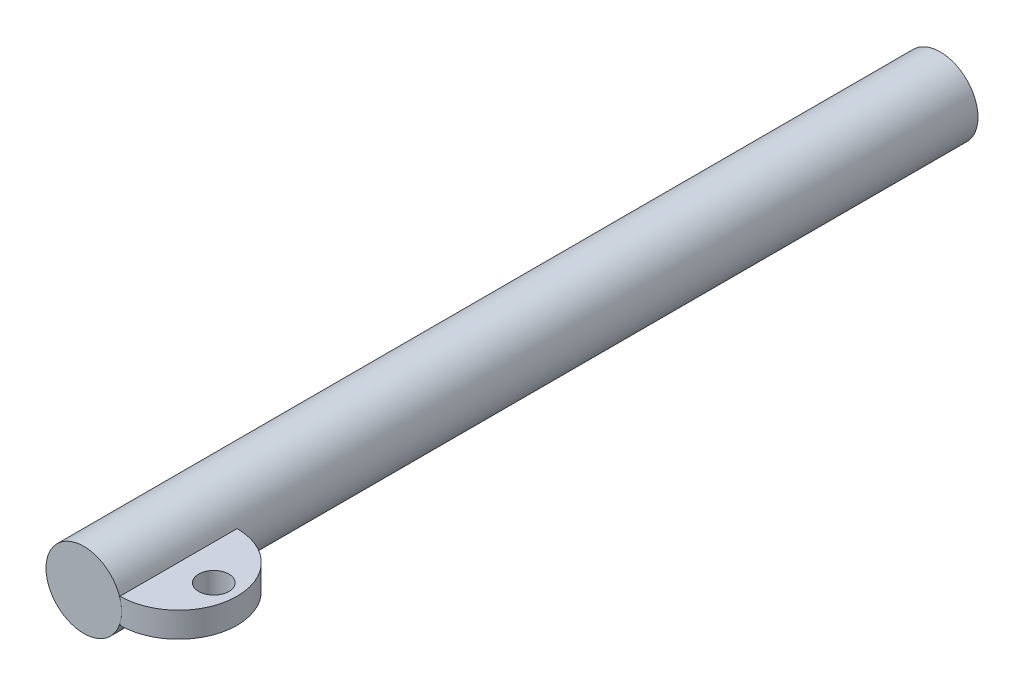
ISO-10303-21;
HEADER;
FILE_DESCRIPTION(('STEP AP214'),'2;1');
FILE_NAME('part.step','',(''),(''),'','','');
FILE_SCHEMA(('AUTOMOTIVE_DESIGN { 1 0 10303 214 1 1 1 1 }'));
ENDSEC;
DATA;
#1=APPLICATION_CONTEXT('core data for automotive mechanical design processes');
#2=APPLICATION_PROTOCOL_DEFINITION('international standard','automotive_design',2000,#1);
#3=PRODUCT_CONTEXT('',#1,'mechanical');
#4=PRODUCT('Part','Part','',(#3));
#5=PRODUCT_RELATED_PRODUCT_CATEGORY('part','',(#4));
#6=PRODUCT_DEFINITION_FORMATION('','',#4);
#7=PRODUCT_DEFINITION_CONTEXT('part definition',#1,'design');
#8=PRODUCT_DEFINITION('design','',#6,#7);
#9=PRODUCT_DEFINITION_SHAPE('','',#8);
#10=(LENGTH_UNIT() NAMED_UNIT(*) SI_UNIT(.MILLI.,.METRE.));
#11=(NAMED_UNIT(*) PLANE_ANGLE_UNIT() SI_UNIT($,.RADIAN.));
#12=(NAMED_UNIT(*) SI_UNIT($,.STERADIAN.) SOLID_ANGLE_UNIT());
#13=UNCERTAINTY_MEASURE_WITH_UNIT(LENGTH_MEASURE(1.E-05),#10,'distance_accuracy_value','');
#14=(GEOMETRIC_REPRESENTATION_CONTEXT(3) GLOBAL_UNCERTAINTY_ASSIGNED_CONTEXT((#13)) GLOBAL_UNIT_ASSIGNED_CONTEXT((#10,
#11,#12)) REPRESENTATION_CONTEXT('',''));
#15=CARTESIAN_POINT('',(0.,0.,0.));
#16=DIRECTION('',(0.,0.,1.));
#17=DIRECTION('',(1.,0.,0.));
#18=AXIS2_PLACEMENT_3D('',#15,#16,#17);
#19=CARTESIAN_POINT('',(0.,0.,-431.8));
#20=DIRECTION('',(0.,0.,1.));
#21=DIRECTION('',(1.,0.,0.));
#22=AXIS2_PLACEMENT_3D('',#19,#20,#21);
#23=CYLINDRICAL_SURFACE('',#22,19.05);
#24=CARTESIAN_POINT('',(0.,0.,-431.8));
#25=DIRECTION('',(0.,0.,1.));
#26=DIRECTION('',(1.,0.,0.));
#27=AXIS2_PLACEMENT_3D('',#24,#25,#26);
#28=CIRCLE('',#27,19.05);
#29=CARTESIAN_POINT('',(19.05,0.,-431.8));
#30=VERTEX_POINT('',#29);
#31=EDGE_CURVE('E11',#30,#30,#28,.T.);
#32=ORIENTED_EDGE('',*,*,#31,.T.);
#33=EDGE_LOOP('',(#32));
#34=FACE_BOUND('',#33,.T.);
#35=CARTESIAN_POINT('',(0.,0.,0.));
#36=DIRECTION('',(0.,0.,1.));
#37=DIRECTION('',(1.,0.,0.));
#38=AXIS2_PLACEMENT_3D('',#35,#36,#37);
#39=CIRCLE('',#38,19.05);
#40=CARTESIAN_POINT('',(18.2311661506708,5.52513174382622,0.));
#41=VERTEX_POINT('',#40);
#42=CARTESIAN_POINT('',(18.2311661506708,-5.52513174382622,0.));
#43=VERTEX_POINT('',#42);
#44=EDGE_CURVE('E47',#41,#43,#39,.T.);
#45=ORIENTED_EDGE('',*,*,#44,.F.);
#46=DIRECTION('',(0.,0.,1.));
#47=VECTOR('',#46,1.);
#48=CARTESIAN_POINT('',(18.2311661506708,5.52513174382622,-431.8));
#49=LINE('',#48,#47);
#50=CARTESIAN_POINT('',(18.2311661506708,5.52513174382622,-59.0746447566882));
#51=VERTEX_POINT('',#50);
#52=EDGE_CURVE('E62',#41,#51,#49,.F.);
#53=ORIENTED_EDGE('',*,*,#52,.T.);
#54=CARTESIAN_POINT('',(19.05,0.,-59.0632927164958));
#55=CARTESIAN_POINT('',(19.0499974495223,-0.533410332689084,-59.0632954058932));
#56=CARTESIAN_POINT('',(19.0275730764012,-1.06701268640046,-59.063940947908));
#57=CARTESIAN_POINT('',(18.9380000171682,-2.13068335039977,-59.0662193871342));
#58=CARTESIAN_POINT('',(18.870823131014,-2.66074921938288,-59.0678529068434));
#59=CARTESIAN_POINT('',(18.6919752162013,-3.71468658943576,-59.0711857572808));
#60=CARTESIAN_POINT('',(18.5801955089816,-4.23853971842063,-59.0728852395341));
#61=CARTESIAN_POINT('',(18.3129560661028,-5.27489114842086,-59.0748333147001));
#62=CARTESIAN_POINT('',(18.1575032761627,-5.78739124103923,-59.0750821381873));
#63=CARTESIAN_POINT('',(17.8040975935901,-6.79725269338584,-59.0720851750262));
#64=CARTESIAN_POINT('',(17.6061643924364,-7.29462094581438,-59.0688410047398));
#65=CARTESIAN_POINT('',(17.1691749588654,-8.27091062242221,-59.0563558909595));
#66=CARTESIAN_POINT('',(16.9301168989702,-8.74983122567972,-59.0471146809227));
#67=CARTESIAN_POINT('',(16.4128282149691,-9.68540707613082,-59.0197590281273));
#68=CARTESIAN_POINT('',(16.1346210071084,-10.142075414823,-59.0016498736035));
#69=CARTESIAN_POINT('',(15.541136456744,-11.0299908304216,-58.9534021036874));
#70=CARTESIAN_POINT('',(15.2258602420524,-11.4612386801389,-58.9232638542097));
#71=CARTESIAN_POINT('',(14.5657555414277,-12.2889126677761,-58.8481884743355));
#72=CARTESIAN_POINT('',(14.2214215462537,-12.6857528753035,-58.8034721411439));
#73=CARTESIAN_POINT('',(13.5025006903744,-13.4484036218518,-58.6959434125296));
#74=CARTESIAN_POINT('',(13.127914004805,-13.8142143404805,-58.6331311218608));
#75=CARTESIAN_POINT('',(12.3524357561648,-14.5117768362683,-58.4864075765619));
#76=CARTESIAN_POINT('',(11.9515580098741,-14.8435462717845,-58.4025073396767));
#77=CARTESIAN_POINT('',(11.1277007341616,-15.4707707390735,-58.2108808454866));
#78=CARTESIAN_POINT('',(10.7047227817724,-15.7662283569653,-58.1031562864757));
#79=CARTESIAN_POINT('',(9.87003341365052,-16.3007412185842,-57.8696382452585));
#80=CARTESIAN_POINT('',(9.45941394462734,-16.542229279102,-57.7455015172433));
#81=CARTESIAN_POINT('',(8.6275500456063,-16.9909145284858,-57.4732390338553));
#82=CARTESIAN_POINT('',(8.2063061727696,-17.1981135112363,-57.3251145342414));
#83=CARTESIAN_POINT('',(7.35777227272936,-17.5778762250717,-57.004182867408));
#84=CARTESIAN_POINT('',(6.93048333172923,-17.7504460959309,-56.8313800849875));
#85=CARTESIAN_POINT('',(6.07425235172059,-18.0613794622432,-56.4609261303484));
#86=CARTESIAN_POINT('',(5.64531029775275,-18.199742647412,-56.2632747327557));
#87=CARTESIAN_POINT('',(4.80214886916259,-18.439863696832,-55.8494715066232));
#88=CARTESIAN_POINT('',(4.38785663721806,-18.5425474571487,-55.6340023414693));
#89=CARTESIAN_POINT('',(3.56527364267798,-18.7181250911846,-55.1807530956983));
#90=CARTESIAN_POINT('',(3.15698260089155,-18.7910203549974,-54.9429740568185));
#91=CARTESIAN_POINT('',(2.34937215791158,-18.9089804047507,-54.4460931602824));
#92=CARTESIAN_POINT('',(1.95005472263788,-18.9540391485085,-54.1869866871242));
#93=CARTESIAN_POINT('',(1.16300961286429,-19.0185671682213,-53.6487078873416));
#94=CARTESIAN_POINT('',(0.775284343316429,-19.0380311697099,-53.3695314372709));
#95=CARTESIAN_POINT('',(-0.134556596742535,-19.0568681592176,-52.6802197263516));
#96=CARTESIAN_POINT('',(-0.650324843735161,-19.045490059431,-52.2613631975699));
#97=CARTESIAN_POINT('',(-1.65121616525916,-18.9849307792628,-51.3910313832574));
#98=CARTESIAN_POINT('',(-2.13632927143914,-18.9357373699677,-50.9395455887021));
#99=CARTESIAN_POINT('',(-3.07399765655121,-18.8063146962617,-50.0063676909387));
#100=CARTESIAN_POINT('',(-3.52648480965315,-18.7260226011192,-49.524616101235));
#101=CARTESIAN_POINT('',(-4.39600780414732,-18.5411762577534,-48.5346534501916));
#102=CARTESIAN_POINT('',(-4.8130430250869,-18.4366215850243,-48.0264419260212));
#103=CARTESIAN_POINT('',(-5.72307186041503,-18.1777738319722,-46.8391764633674));
#104=CARTESIAN_POINT('',(-6.20432554341778,-18.0177688882982,-46.1523569886721));
#105=CARTESIAN_POINT('',(-7.10535866264219,-17.6818432432793,-44.7430361253001));
#106=CARTESIAN_POINT('',(-7.5251232603516,-17.5059187167449,-44.0205261798848));
#107=CARTESIAN_POINT('',(-8.10762091903377,-17.2399125735263,-42.9125204730872));
#108=CARTESIAN_POINT('',(-8.29397886114145,-17.1508628052949,-42.5390260147538));
#109=CARTESIAN_POINT('',(-8.65072584911805,-16.9737175187501,-41.7844216991225));
#110=CARTESIAN_POINT('',(-8.82111986190445,-16.8856217112228,-41.4033142555545));
#111=CARTESIAN_POINT('',(-9.30810183725057,-16.6252007952014,-40.2489753021264));
#112=CARTESIAN_POINT('',(-9.60060813524538,-16.4566862426988,-39.4645020133286));
#113=CARTESIAN_POINT('',(-10.078136561872,-16.1678331754576,-37.9952068825379));
#114=CARTESIAN_POINT('',(-10.2728341536033,-16.0440880173047,-37.3141757470449));
#115=CARTESIAN_POINT('',(-10.6134693950877,-15.8208193897522,-35.9360684439627));
#116=CARTESIAN_POINT('',(-10.7594124281181,-15.7212932465188,-35.238994056894));
#117=CARTESIAN_POINT('',(-11.0006403265369,-15.5534586096181,-33.8340272999519));
#118=CARTESIAN_POINT('',(-11.0960415326009,-15.4850784732955,-33.1261636671064));
#119=CARTESIAN_POINT('',(-11.2353457906023,-15.3843099270789,-31.7027999762613));
#120=CARTESIAN_POINT('',(-11.2792509392299,-15.3519200518245,-30.9873002303673));
#121=CARTESIAN_POINT('',(-11.3149104574173,-15.3256592376619,-29.5516572830223));
#122=CARTESIAN_POINT('',(-11.3064737233067,-15.3319294487663,-28.8315066670718));
#123=CARTESIAN_POINT('',(-11.2371461511756,-15.3828097321299,-27.3951105338666));
#124=CARTESIAN_POINT('',(-11.1762534007598,-15.4274212022007,-26.6788651599439));
#125=CARTESIAN_POINT('',(-11.0028690196664,-15.5515479281147,-25.2548103004364));
#126=CARTESIAN_POINT('',(-10.8903082042545,-15.6311099774305,-24.5470134355544));
#127=CARTESIAN_POINT('',(-10.615062337509,-15.8193119260165,-23.1452291037281));
#128=CARTESIAN_POINT('',(-10.452374620779,-15.9279533714842,-22.451242373199));
#129=CARTESIAN_POINT('',(-10.0836465736133,-16.1638193390707,-21.0991721541365));
#130=CARTESIAN_POINT('',(-9.87891481023732,-16.2904537943834,-20.4406258764063));
#131=CARTESIAN_POINT('',(-9.42498400488311,-16.5572172119949,-19.1419404844225));
#132=CARTESIAN_POINT('',(-9.17578694618822,-16.6973455722976,-18.5018005506696));
#133=CARTESIAN_POINT('',(-8.63364164766201,-16.984018017731,-17.2406856381606));
#134=CARTESIAN_POINT('',(-8.34063091916859,-17.1305710514518,-16.6197395861384));
#135=CARTESIAN_POINT('',(-7.71197767345019,-17.4226307883418,-15.3995057824057));
#136=CARTESIAN_POINT('',(-7.37633045594906,-17.5681373742785,-14.8002204279563));
#137=CARTESIAN_POINT('',(-6.58494548921102,-17.8818248471692,-13.4962504224883));
#138=CARTESIAN_POINT('',(-6.11900582923667,-18.0479928569209,-12.7972252974813));
#139=CARTESIAN_POINT('',(-5.12609036375175,-18.3547242361447,-11.4375727357206));
#140=CARTESIAN_POINT('',(-4.59909676141984,-18.4952801089742,-10.7769565796312));
#141=CARTESIAN_POINT('',(-3.48757225709849,-18.7366388314036,-9.50077922376731));
#142=CARTESIAN_POINT('',(-2.90319958478497,-18.8375473676265,-8.88510185328883));
#143=CARTESIAN_POINT('',(-1.98621448064334,-18.9486734699456,-7.99917633549305));
#144=CARTESIAN_POINT('',(-1.67389615226275,-18.9790068921689,-7.71019878539144));
#145=CARTESIAN_POINT('',(-1.03634152792483,-19.0244746814373,-7.14540692538731));
#146=CARTESIAN_POINT('',(-0.711102643313344,-19.0396059865859,-6.86959527791303));
#147=CARTESIAN_POINT('',(0.0306760328246975,-19.0544002431947,-6.26770596591488));
#148=CARTESIAN_POINT('',(0.450414287587034,-19.0494862522862,-5.94542584701397));
#149=CARTESIAN_POINT('',(1.30558757245027,-19.0100257982271,-5.32457185031872));
#150=CARTESIAN_POINT('',(1.74101765993906,-18.9754885889813,-5.02599060112869));
#151=CARTESIAN_POINT('',(2.62430476366712,-18.873605987584,-4.45434389512109));
#152=CARTESIAN_POINT('',(3.0721541351599,-18.8062803735253,-4.18126317447804));
#153=CARTESIAN_POINT('',(3.9766511103939,-18.635999800388,-3.66196466576827));
#154=CARTESIAN_POINT('',(4.43329896928359,-18.5330438065866,-3.41574765810948));
#155=CARTESIAN_POINT('',(5.35379359973416,-18.2884557295841,-2.94983479134847));
#156=CARTESIAN_POINT('',(5.81766794160454,-18.146574465427,-2.73032342399081));
#157=CARTESIAN_POINT('',(6.74437860977575,-17.822926315774,-2.32034522760761));
#158=CARTESIAN_POINT('',(7.20721493347212,-17.6411593303151,-2.12987847137677));
#159=CARTESIAN_POINT('',(8.12615135630616,-17.2371703061297,-1.77792435643122));
#160=CARTESIAN_POINT('',(8.58225217847091,-17.0149526442425,-1.61643386618031));
#161=CARTESIAN_POINT('',(9.48203796398859,-16.5304109946022,-1.32154107592938));
#162=CARTESIAN_POINT('',(9.92572380753314,-16.268089858654,-1.18813678028951));
#163=CARTESIAN_POINT('',(10.7531878629985,-15.7318334602047,-0.959368970685725));
#164=CARTESIAN_POINT('',(11.1386143968101,-15.4614643027558,-0.861576313698964));
#165=CARTESIAN_POINT('',(11.8911214153813,-14.890492280394,-0.685866141013246));
#166=CARTESIAN_POINT('',(12.25820323811,-14.5898916252428,-0.607947174123208));
#167=CARTESIAN_POINT('',(12.9707281556607,-13.9602575991614,-0.469935973060626));
#168=CARTESIAN_POINT('',(13.3161691193484,-13.6312214355459,-0.409845492420103));
#169=CARTESIAN_POINT('',(13.9824780087536,-12.9468496941845,-0.30521969771515));
#170=CARTESIAN_POINT('',(14.3033449712681,-12.5915130866382,-0.26068499313197));
#171=CARTESIAN_POINT('',(14.9231151502026,-11.8507472894319,-0.184139412194319));
#172=CARTESIAN_POINT('',(15.2215650182474,-11.4649162932427,-0.152348845929239));
#173=CARTESIAN_POINT('',(15.7882877708358,-10.6710054178453,-0.0998161916742808));
#174=CARTESIAN_POINT('',(16.0565606355922,-10.2629255240489,-0.0790741109288467));
#175=CARTESIAN_POINT('',(16.5611558595042,-9.42703564038576,-0.0461636729643781));
#176=CARTESIAN_POINT('',(16.7974716369988,-8.99922161047012,-0.0339970797268072));
#177=CARTESIAN_POINT('',(17.236578302324,-8.12659062515477,-0.0159316852545957));
#178=CARTESIAN_POINT('',(17.4393678283022,-7.68177297996326,-0.0100331385782049));
#179=CARTESIAN_POINT('',(17.8227411775373,-6.74718266716878,-0.00215923396223149));
#180=CARTESIAN_POINT('',(18.0008886358895,-6.256406380601,-0.000476852441465727));
#181=CARTESIAN_POINT('',(18.3163122466992,-5.26187995269378,0.000298576705540255));
#182=CARTESIAN_POINT('',(18.4535867565348,-4.75812929081758,-0.000608479718299262));
#183=CARTESIAN_POINT('',(18.6863456416408,-3.74101310472437,-0.00327776447527872));
#184=CARTESIAN_POINT('',(18.7818260168249,-3.22764666508942,-0.00504007463011122));
#185=CARTESIAN_POINT('',(18.930333319352,-2.19481017686697,-0.00818253938248962));
#186=CARTESIAN_POINT('',(18.9833600771956,-1.67534010391862,-0.00956269245422767));
#187=CARTESIAN_POINT('',(19.0474144453072,-0.620388227821674,-0.0112621697412922));
#188=CARTESIAN_POINT('',(19.0573265446651,-0.0848382933953442,-0.0115532910097897));
#189=CARTESIAN_POINT('',(19.0320334545954,0.985202023899301,-0.0108566730105992));
#190=CARTESIAN_POINT('',(18.9968272873136,1.51969238355186,-0.00986890602539218));
#191=CARTESIAN_POINT('',(18.8815411668343,2.58386744353937,-0.00710492857852447));
#192=CARTESIAN_POINT('',(18.8014564537616,3.11355162806877,-0.00532863448883607));
#193=CARTESIAN_POINT('',(18.5969782930749,4.16429685115964,-0.00208861534656412));
#194=CARTESIAN_POINT('',(18.4725849552536,4.68535791108505,-0.000624889519480349));
#195=CARTESIAN_POINT('',(18.1802544290642,5.7155730687006,0.000317709824677832));
#196=CARTESIAN_POINT('',(18.012282561266,6.22471732969071,-0.000205001990828593));
#197=CARTESIAN_POINT('',(17.6340414536482,7.2270328993203,-0.00543109863459785));
#198=CARTESIAN_POINT('',(17.4237719263452,7.72020409936966,-0.0101345118784618));
#199=CARTESIAN_POINT('',(16.9624520862124,8.68703814784868,-0.0263579405815006));
#200=CARTESIAN_POINT('',(16.7113982046049,9.16069928452688,-0.0378785528034052));
#201=CARTESIAN_POINT('',(16.170437558122,10.0849463755609,-0.0707276929399375));
#202=CARTESIAN_POINT('',(15.8805313327437,10.5355326502103,-0.0920560846753777));
#203=CARTESIAN_POINT('',(15.267246535575,11.4058884904745,-0.147487122254798));
#204=CARTESIAN_POINT('',(14.9442243152059,11.8259170548654,-0.181462370371761));
#205=CARTESIAN_POINT('',(14.2651854469612,12.6367152921659,-0.265469077866318));
#206=CARTESIAN_POINT('',(13.9091689031214,13.0274850573255,-0.31550048661783));
#207=CARTESIAN_POINT('',(13.1677359062566,13.7764554375965,-0.434814835197666));
#208=CARTESIAN_POINT('',(12.7823366245936,14.1346748109837,-0.504086592533626));
#209=CARTESIAN_POINT('',(11.9859792655049,14.8159819687339,-0.66491393718613));
#210=CARTESIAN_POINT('',(11.5750229543609,15.13907217669,-0.756467985813961));
#211=CARTESIAN_POINT('',(10.7573535018251,15.7296161294484,-0.958272023605794));
#212=CARTESIAN_POINT('',(10.3518499010452,15.9992391522402,-1.06708076640823));
#213=CARTESIAN_POINT('',(9.52665415652276,16.5039157167473,-1.3084432393912));
#214=CARTESIAN_POINT('',(9.10696269137225,16.7389709089398,-1.44099583522583));
#215=CARTESIAN_POINT('',(8.25811175946128,17.1736254134505,-1.73097997130549));
#216=CARTESIAN_POINT('',(7.82895522083179,17.3732355228436,-1.88840390767997));
#217=CARTESIAN_POINT('',(6.96575248436744,17.7369713111046,-2.22873274050004));
#218=CARTESIAN_POINT('',(6.53170632635866,17.9010972787723,-2.41163742954192));
#219=CARTESIAN_POINT('',(5.68280680373717,18.187905001981,-2.7941167717452));
#220=CARTESIAN_POINT('',(5.26796493174674,18.312114297515,-2.992577208481));
#221=CARTESIAN_POINT('',(4.44179681439558,18.5298526265836,-3.41221258525258));
#222=CARTESIAN_POINT('',(4.0304703646842,18.6233834554275,-3.63338619511444));
#223=CARTESIAN_POINT('',(3.21457476659942,18.7814199936813,-4.09767294891118));
#224=CARTESIAN_POINT('',(2.81000738610834,18.8459182204027,-4.34079172950162));
#225=CARTESIAN_POINT('',(2.01059212044677,18.9478884209157,-4.84783896586644));
#226=CARTESIAN_POINT('',(1.6157461484833,18.9853551152291,-5.11177147557154));
#227=CARTESIAN_POINT('',(0.707785659157291,19.0439524176241,-5.75103620978446));
#228=CARTESIAN_POINT('',(0.199420626400551,19.0553893581941,-6.13404161738727));
#229=CARTESIAN_POINT('',(-0.791142802913183,19.0400154174703,-6.93179202572708));
#230=CARTESIAN_POINT('',(-1.27333387733466,19.0131938900722,-7.3465458306288));
#231=CARTESIAN_POINT('',(-2.20910159961285,18.9273206513257,-8.2053556616615));
#232=CARTESIAN_POINT('',(-2.66263250416816,18.8682187994527,-8.64945632605585));
#233=CARTESIAN_POINT('',(-3.53816398474533,18.723803265189,-9.56357937065311));
#234=CARTESIAN_POINT('',(-3.96016319563589,18.6384884487524,-10.0336028716283));
#235=CARTESIAN_POINT('',(-4.89694121486842,18.4179325476437,-11.1464475384984));
#236=CARTESIAN_POINT('',(-5.39999806843685,18.2754118478442,-11.7977162109228));
#237=CARTESIAN_POINT('',(-6.34799775785515,17.9681337033784,-13.1363674018079));
#238=CARTESIAN_POINT('',(-6.79292240437751,17.8033693313915,-13.8237611297599));
#239=CARTESIAN_POINT('',(-7.62402294859989,17.4636363122966,-15.2323433503774));
#240=CARTESIAN_POINT('',(-8.0101002531535,17.2886512051026,-15.9535859666374));
#241=CARTESIAN_POINT('',(-8.72134421754388,16.940996265663,-17.426005455576));
#242=CARTESIAN_POINT('',(-9.0465142230987,16.7683263067273,-18.1771806812665));
#243=CARTESIAN_POINT('',(-9.63932513505467,16.4348277826158,-19.7198104728397));
#244=CARTESIAN_POINT('',(-9.9058931709862,16.2742506556207,-20.5117328914951));
#245=CARTESIAN_POINT('',(-10.3720516928345,15.9812132553763,-22.1204485350826));
#246=CARTESIAN_POINT('',(-10.5716428268141,15.8487527100778,-22.9372415192858));
#247=CARTESIAN_POINT('',(-10.8184294285479,15.6803632266735,-24.1753322226918));
#248=CARTESIAN_POINT('',(-10.8918503195527,15.6293403847389,-24.5895155451441));
#249=CARTESIAN_POINT('',(-11.0210700633854,15.5384943216174,-25.4218225741537));
#250=CARTESIAN_POINT('',(-11.0768714571214,15.4986694856567,-25.8399457035868));
#251=CARTESIAN_POINT('',(-11.1705736395845,15.4312704863317,-26.6791143348607));
#252=CARTESIAN_POINT('',(-11.2084769531141,15.4036945950961,-27.1001594160068));
#253=CARTESIAN_POINT('',(-11.2661903617008,15.3615346271296,-27.9441343167524));
#254=CARTESIAN_POINT('',(-11.2860011270713,15.3469500690815,-28.3670640659431));
#255=CARTESIAN_POINT('',(-11.3061512082244,15.332108917427,-29.1635601438227));
#256=CARTESIAN_POINT('',(-11.3085161148664,15.330361900003,-29.5370494768504));
#257=CARTESIAN_POINT('',(-11.2990834445212,15.3373155824527,-30.2837876804053));
#258=CARTESIAN_POINT('',(-11.2872845789055,15.3460172329524,-30.6570365259614));
#259=CARTESIAN_POINT('',(-11.2495757346504,15.3736821015926,-31.4023902875173));
#260=CARTESIAN_POINT('',(-11.2236677044801,15.3926439028089,-31.7744953543382));
#261=CARTESIAN_POINT('',(-11.1578589608889,15.4404108294176,-32.5168452007518));
#262=CARTESIAN_POINT('',(-11.1179566179117,15.4692171011315,-32.8870897586041));
#263=CARTESIAN_POINT('',(-10.977349317935,15.5696478030383,-33.9949417553797));
#264=CARTESIAN_POINT('',(-10.8557898291239,15.6552485219075,-34.7287717488306));
#265=CARTESIAN_POINT('',(-10.5588513942361,15.8570211730949,-36.1809728728563));
#266=CARTESIAN_POINT('',(-10.3834691694541,15.9731949677635,-36.8993430588164));
#267=CARTESIAN_POINT('',(-9.99270345363388,16.2203106603588,-38.2749897467968));
#268=CARTESIAN_POINT('',(-9.7803265142434,16.3499599508232,-38.9333558717626));
#269=CARTESIAN_POINT('',(-9.31104285849038,16.6216887109897,-40.2310843886419));
#270=CARTESIAN_POINT('',(-9.05413971702631,16.7637671823305,-40.8704483013718));
#271=CARTESIAN_POINT('',(-8.21728597024945,17.1980716502097,-42.759676117477));
#272=CARTESIAN_POINT('',(-7.57149894249956,17.498150498321,-43.9795982016577));
#273=CARTESIAN_POINT('',(-6.39703217096823,17.9501583454243,-45.8656580811192));
#274=CARTESIAN_POINT('',(-5.92084856988596,18.1142362834329,-46.5622794330686));
#275=CARTESIAN_POINT('',(-4.90705725987192,18.414744750455,-47.9164191939587));
#276=CARTESIAN_POINT('',(-4.36943134606732,18.5511670519376,-48.5739259253457));
#277=CARTESIAN_POINT('',(-3.2367287923856,18.7818790585149,-49.8425748751319));
#278=CARTESIAN_POINT('',(-2.64181938748552,18.8762871411935,-50.4538432813942));
#279=CARTESIAN_POINT('',(-1.70933062560048,18.9757310087083,-51.3321034248811));
#280=CARTESIAN_POINT('',(-1.39190025032133,19.0018496235118,-51.6183478507401));
#281=CARTESIAN_POINT('',(-0.74428882919032,19.0382173613798,-52.1772964510454));
#282=CARTESIAN_POINT('',(-0.414105232933398,19.0484632931875,-52.4499978919636));
#283=CARTESIAN_POINT('',(0.33319135777726,19.0515249628034,-53.0403121055311));
#284=CARTESIAN_POINT('',(0.753208499857048,19.0399219681683,-53.354301004765));
#285=CARTESIAN_POINT('',(1.60799757198811,18.9868410539792,-53.9585738505735));
#286=CARTESIAN_POINT('',(2.04276478251263,18.9453726060455,-54.2488652801466));
#287=CARTESIAN_POINT('',(2.92370319671904,18.8295422970567,-54.8040165792491));
#288=CARTESIAN_POINT('',(3.36986742759582,18.7552001148557,-55.0688915482933));
#289=CARTESIAN_POINT('',(4.26991315219784,18.5709804117403,-55.5719646785706));
#290=CARTESIAN_POINT('',(4.72379488515237,18.4611017873479,-55.8101620111));
#291=CARTESIAN_POINT('',(5.63744312462765,18.2029781103342,-56.2602046414656));
#292=CARTESIAN_POINT('',(6.09722864727271,18.0545022374913,-56.471879638069));
#293=CARTESIAN_POINT('',(7.01470379072052,17.7182140103479,-56.8666801944345));
#294=CARTESIAN_POINT('',(7.47239340670486,17.5304015656607,-57.0498056885944));
#295=CARTESIAN_POINT('',(8.38013282269813,17.1150514137256,-57.3877286856314));
#296=CARTESIAN_POINT('',(8.83018288295492,16.8875150626978,-57.5425271552564));
#297=CARTESIAN_POINT('',(9.71710610000621,16.3932311938509,-57.8247892030698));
#298=CARTESIAN_POINT('',(10.1539800843855,16.1264861449241,-57.9522545011309));
#299=CARTESIAN_POINT('',(10.9706205974429,15.5809796224302,-58.1712221269955));
#300=CARTESIAN_POINT('',(11.3519812569452,15.3054792965095,-58.2649327627727));
#301=CARTESIAN_POINT('',(12.0957943098442,14.7247025373268,-58.4329275075906));
#302=CARTESIAN_POINT('',(12.4582479877848,14.4194281309763,-58.5072129377631));
#303=CARTESIAN_POINT('',(13.161014827574,13.7809862772712,-58.6384357473032));
#304=CARTESIAN_POINT('',(13.5013283106981,13.4478192348262,-58.6953733784482));
#305=CARTESIAN_POINT('',(14.1570246176618,12.7557208560081,-58.7941975558759));
#306=CARTESIAN_POINT('',(14.4724064888951,12.3967885361743,-58.8360835272698));
#307=CARTESIAN_POINT('',(15.0824249871818,11.6473801015272,-58.9079751588353));
#308=CARTESIAN_POINT('',(15.3764583468092,11.2563863867119,-58.9377014698468));
#309=CARTESIAN_POINT('',(15.9338378243964,10.4524909143376,-58.986498738411));
#310=CARTESIAN_POINT('',(16.1971835127209,10.0395888501739,-59.0055695467981));
#311=CARTESIAN_POINT('',(16.6916013363541,9.19417914540572,-59.0355352687876));
#312=CARTESIAN_POINT('',(16.9226475841208,8.76165614245559,-59.0464236545295));
#313=CARTESIAN_POINT('',(17.3507376380949,7.88001040298634,-59.0622973955777));
#314=CARTESIAN_POINT('',(17.5477813831613,7.43088763662034,-59.0672827402695));
#315=CARTESIAN_POINT('',(17.9188742235789,6.48771319463607,-59.073616652467));
#316=CARTESIAN_POINT('',(18.0904468432595,5.99268365175076,-59.0746947187922));
#317=CARTESIAN_POINT('',(18.3922727839839,4.99008324051799,-59.0745912767041));
#318=CARTESIAN_POINT('',(18.5225179771999,4.48250992632934,-59.0734093241357));
#319=CARTESIAN_POINT('',(18.7405232208655,3.45951511729214,-59.0704534604395));
#320=CARTESIAN_POINT('',(18.8283761922608,2.94411336530781,-59.0686808585383));
#321=CARTESIAN_POINT('',(18.9613906778497,1.90805317521456,-59.0656927373984));
#322=CARTESIAN_POINT('',(19.0065782230892,1.38739813849858,-59.0644768787129));
#323=CARTESIAN_POINT('',(19.0368722615349,0.721710057486372,-59.0636539376601));
#324=CARTESIAN_POINT('',(19.0417944011711,0.577414963933451,-59.0635193346191));
#325=CARTESIAN_POINT('',(19.048358605295,0.288751269531741,-59.0633383603328));
#326=CARTESIAN_POINT('',(19.0500006903593,0.144382669149767,-59.063291988534));
#327=CARTESIAN_POINT('',(19.05,0.,-59.0632927164958));
#328=B_SPLINE_CURVE_WITH_KNOTS('',3,(#54,#55,#56,#57,#58,#59,#60,#61,#62,#63,#64,#65,#66,#67,
#68,#69,#70,#71,#72,#73,#74,#75,#76,#77,#78,#79,#80,#81,#82,#83,#84,#85,#86,#87,#88,#89,#90,#91,
#92,#93,#94,#95,#96,#97,#98,#99,#100,#101,#102,#103,#104,#105,#106,#107,#108,#109,#110,#111,
#112,#113,#114,#115,#116,#117,#118,#119,#120,#121,#122,#123,#124,#125,#126,#127,#128,#129,#130,
#131,#132,#133,#134,#135,#136,#137,#138,#139,#140,#141,#142,#143,#144,#145,#146,#147,#148,#149,
#150,#151,#152,#153,#154,#155,#156,#157,#158,#159,#160,#161,#162,#163,#164,#165,#166,#167,#168,
#169,#170,#171,#172,#173,#174,#175,#176,#177,#178,#179,#180,#181,#182,#183,#184,#185,#186,#187,
#188,#189,#190,#191,#192,#193,#194,#195,#196,#197,#198,#199,#200,#201,#202,#203,#204,#205,#206,
#207,#208,#209,#210,#211,#212,#213,#214,#215,#216,#217,#218,#219,#220,#221,#222,#223,#224,#225,
#226,#227,#228,#229,#230,#231,#232,#233,#234,#235,#236,#237,#238,#239,#240,#241,#242,#243,#244,
#245,#246,#247,#248,#249,#250,#251,#252,#253,#254,#255,#256,#257,#258,#259,#260,#261,#262,#263,
#264,#265,#266,#267,#268,#269,#270,#271,#272,#273,#274,#275,#276,#277,#278,#279,#280,#281,#282,
#283,#284,#285,#286,#287,#288,#289,#290,#291,#292,#293,#294,#295,#296,#297,#298,#299,#300,#301,
#302,#303,#304,#305,#306,#307,#308,#309,#310,#311,#312,#313,#314,#315,#316,#317,#318,#319,#320,
#321,#322,#323,#324,#325,#326,#327),.UNSPECIFIED.,.T.,.F.,(4,2,2,2,2,2,2,2,2,2,2,2,2,2,2,2,2,2,
2,2,2,2,2,2,2,2,2,2,2,2,2,2,2,2,2,2,2,2,2,2,2,2,2,2,2,2,2,2,2,2,2,2,2,2,2,2,2,2,2,2,2,2,2,2,2,2,
2,2,2,2,2,2,2,2,2,2,2,2,2,2,2,2,2,2,2,2,2,2,2,2,2,2,2,2,2,2,2,2,2,2,2,2,2,2,2,2,2,2,2,2,2,2,2,2,
2,2,2,2,2,2,2,2,2,2,2,2,2,2,2,2,2,2,2,2,2,2,4),(0.,1.60009306059019,3.20119534777752,
4.80622291464045,6.4109953640474,8.01502553360993,9.61912700036772,11.22227305361,
12.8253703442843,14.4052353193065,15.9850911489786,17.5641232665217,19.1430428605305,
20.6180004900669,22.0928809305765,23.567499641887,25.0421317287819,26.4749917906154,
27.9077849797484,29.3408890611716,30.774288424932,32.7648883685994,34.7561323138729,
36.7514204646625,38.7467435282751,41.3046961887617,43.8632651196416,45.1433404625217,
46.4230161988106,48.9815886526646,51.1367357747127,53.2916448556017,55.4415718251673,
57.5914112562376,59.7491045008715,61.9068764121107,64.0675460963787,66.2283306897065,
68.3299690720336,70.4315137385084,72.536084809811,74.6408880921666,77.2066385645141,
79.7731388269252,82.3327504675348,83.6119327929998,84.8913727101595,86.4774826836189,
88.0630973575147,89.6477567649149,91.2324621954267,92.827558894107,94.4226595905226,
96.0175877965237,97.6124026380288,99.0532527295227,100.49399757897,101.934884086847,
103.375827042876,104.840704321676,106.305582560987,107.770762038513,109.236001017713,
110.800542727566,112.365147305495,113.929901597871,115.494662137625,117.099675828211,
118.70472430506,120.309943047607,121.915157812602,123.521653933444,125.128160973483,
126.734808664453,128.341434048093,129.932294815814,131.523150567501,133.11308364149,
134.70290695485,136.197882654801,137.692786952376,139.187235096804,140.681671077698,
142.109142539199,143.536530449905,144.964286036651,146.392320400254,148.299310510892,
150.206831379224,152.117323631231,154.02789854811,156.529953244959,159.032788959047,
161.539772905187,164.04661909899,166.596114632335,169.145585496267,170.416316259234,
171.68686368631,172.957231829346,174.227552904428,175.34764930967,176.467847629679,
177.587891290046,178.708065416313,180.951096508669,183.194264266283,185.303757992268,
187.413082430618,191.635128556396,194.211190846614,196.788018392346,199.357538879378,
200.641639841699,201.925998943387,203.498070180032,205.069643064667,206.640276446227,
208.210958603801,209.791258983971,211.371562995363,212.9518130639,214.531963669888,
215.969400389796,217.406739322439,218.844057393253,220.281430355704,221.750185495142,
223.218961195061,224.688907430175,226.158856308427,227.728812161961,229.299076586198,
230.865883280871,232.431733415951,232.864846803761,233.297957474511),.UNSPECIFIED.);
#329=CARTESIAN_POINT('',(18.2311661506708,-5.52513174382622,-59.0746447566882));
#330=VERTEX_POINT('',#329);
#331=EDGE_CURVE('E113',#51,#330,#328,.T.);
#332=ORIENTED_EDGE('',*,*,#331,.T.);
#333=DIRECTION('',(0.,0.,1.));
#334=VECTOR('',#333,1.);
#335=CARTESIAN_POINT('',(18.2311661506708,-5.52513174382622,-431.8));
#336=LINE('',#335,#334);
#337=EDGE_CURVE('E86',#330,#43,#336,.T.);
#338=ORIENTED_EDGE('',*,*,#337,.T.);
#339=EDGE_LOOP('',(#45,#53,#332,#338));
#340=FACE_BOUND('',#339,.T.);
#341=ADVANCED_FACE('F39',(#34,#340),#23,.T.);
#342=EDGE_CURVE('E147',#43,#41,#39,.T.);
#343=ORIENTED_EDGE('',*,*,#342,.F.);
#344=EDGE_CURVE('E118',#43,#41,#328,.T.);
#345=ORIENTED_EDGE('',*,*,#344,.T.);
#346=EDGE_LOOP('',(#343,#345));
#347=FACE_BOUND('',#346,.T.);
#348=ADVANCED_FACE('F131',(#347),#23,.T.);
#349=CARTESIAN_POINT('',(0.,0.,-431.8));
#350=DIRECTION('',(0.,0.,1.));
#351=DIRECTION('',(1.,0.,0.));
#352=AXIS2_PLACEMENT_3D('',#349,#350,#351);
#353=PLANE('',#352);
#354=ORIENTED_EDGE('',*,*,#31,.F.);
#355=EDGE_LOOP('',(#354));
#356=FACE_BOUND('',#355,.T.);
#357=ADVANCED_FACE('F128',(#356),#353,.F.);
#358=CARTESIAN_POINT('',(0.,0.,0.));
#359=DIRECTION('',(0.,0.,1.));
#360=DIRECTION('',(1.,0.,0.));
#361=AXIS2_PLACEMENT_3D('',#358,#359,#360);
#362=PLANE('',#361);
#363=ORIENTED_EDGE('',*,*,#342,.T.);
#364=ORIENTED_EDGE('',*,*,#44,.T.);
#365=EDGE_LOOP('',(#363,#364));
#366=FACE_BOUND('',#365,.T.);
#367=ADVANCED_FACE('F125',(#366),#362,.T.);
#368=CARTESIAN_POINT('',(18.2311661506708,6.35000000000001,-59.0746447566882));
#369=DIRECTION('',(1.,0.,0.));
#370=DIRECTION('',(0.,0.,-1.));
#371=AXIS2_PLACEMENT_3D('',#368,#369,#370);
#372=PLANE('',#371);
#373=ORIENTED_EDGE('',*,*,#52,.F.);
#374=DIRECTION('',(0.,-1.,0.));
#375=VECTOR('',#374,1.);
#376=CARTESIAN_POINT('',(18.2311661506708,6.35000000000001,0.));
#377=LINE('',#376,#375);
#378=CARTESIAN_POINT('',(18.2311661506708,6.35000000000001,0.));
#379=VERTEX_POINT('',#378);
#380=EDGE_CURVE('E90',#379,#41,#377,.T.);
#381=ORIENTED_EDGE('',*,*,#380,.F.);
#382=DIRECTION('',(0.,0.,1.));
#383=VECTOR('',#382,1.);
#384=CARTESIAN_POINT('',(18.2311661506708,6.35000000000001,-59.0746447566882));
#385=LINE('',#384,#383);
#386=CARTESIAN_POINT('',(18.2311661506708,6.35000000000001,-59.0746447566882));
#387=VERTEX_POINT('',#386);
#388=EDGE_CURVE('E108',#387,#379,#385,.T.);
#389=ORIENTED_EDGE('',*,*,#388,.F.);
#390=DIRECTION('',(0.,-1.,0.));
#391=VECTOR('',#390,1.);
#392=CARTESIAN_POINT('',(18.2311661506708,6.35000000000001,-59.0746447566882));
#393=LINE('',#392,#391);
#394=EDGE_CURVE('E89',#387,#51,#393,.T.);
#395=ORIENTED_EDGE('',*,*,#394,.T.);
#396=EDGE_LOOP('',(#373,#381,#389,#395));
#397=FACE_BOUND('',#396,.T.);
#398=ADVANCED_FACE('F127',(#397),#372,.F.);
#399=CARTESIAN_POINT('',(18.2311661506708,6.35000000000001,-29.5373223783441));
#400=DIRECTION('',(0.,1.,0.));
#401=DIRECTION('',(0.,0.,1.));
#402=AXIS2_PLACEMENT_3D('',#399,#400,#401);
#403=PLANE('',#402);
#404=CARTESIAN_POINT('',(18.2311661506708,6.35000000000001,-29.5373223783441));
#405=DIRECTION('',(0.,1.,0.));
#406=DIRECTION('',(0.,0.,1.));
#407=AXIS2_PLACEMENT_3D('',#404,#405,#406);
#408=CIRCLE('',#407,29.5373223783441);
#409=EDGE_CURVE('E102',#379,#387,#408,.T.);
#410=ORIENTED_EDGE('',*,*,#409,.T.);
#411=ORIENTED_EDGE('',*,*,#388,.T.);
#412=EDGE_LOOP('',(#410,#411));
#413=FACE_BOUND('',#412,.T.);
#414=CARTESIAN_POINT('',(36.0111661506708,6.35000000000001,-29.5373223783441));
#415=DIRECTION('',(0.,1.,0.));
#416=DIRECTION('',(0.,0.,1.));
#417=AXIS2_PLACEMENT_3D('',#414,#415,#416);
#418=CIRCLE('',#417,7.62);
#419=CARTESIAN_POINT('',(36.0111661506708,6.35000000000001,-21.9173223783441));
#420=VERTEX_POINT('',#419);
#421=EDGE_CURVE('E99',#420,#420,#418,.T.);
#422=ORIENTED_EDGE('',*,*,#421,.F.);
#423=EDGE_LOOP('',(#422));
#424=FACE_BOUND('',#423,.T.);
#425=ADVANCED_FACE('F123',(#413,#424),#403,.T.);
#426=CARTESIAN_POINT('',(18.2311661506708,6.35000000000001,-29.5373223783441));
#427=DIRECTION('',(0.,-1.,0.));
#428=DIRECTION('',(0.,0.,-1.));
#429=AXIS2_PLACEMENT_3D('',#426,#427,#428);
#430=CYLINDRICAL_SURFACE('',#429,29.5373223783441);
#431=ORIENTED_EDGE('',*,*,#344,.F.);
#432=CARTESIAN_POINT('',(18.2311661506708,-6.35,0.));
#433=VERTEX_POINT('',#432);
#434=EDGE_CURVE('E54',#43,#433,#377,.T.);
#435=ORIENTED_EDGE('',*,*,#434,.T.);
#436=CARTESIAN_POINT('',(18.2311661506708,-6.35,-29.5373223783441));
#437=DIRECTION('',(0.,1.,0.));
#438=DIRECTION('',(0.,0.,1.));
#439=AXIS2_PLACEMENT_3D('',#436,#437,#438);
#440=CIRCLE('',#439,29.5373223783441);
#441=CARTESIAN_POINT('',(18.2311661506708,-6.35,-59.0746447566882));
#442=VERTEX_POINT('',#441);
#443=EDGE_CURVE('E93',#433,#442,#440,.T.);
#444=ORIENTED_EDGE('',*,*,#443,.T.);
#445=EDGE_CURVE('E80',#330,#442,#393,.T.);
#446=ORIENTED_EDGE('',*,*,#445,.F.);
#447=ORIENTED_EDGE('',*,*,#331,.F.);
#448=ORIENTED_EDGE('',*,*,#394,.F.);
#449=ORIENTED_EDGE('',*,*,#409,.F.);
#450=ORIENTED_EDGE('',*,*,#380,.T.);
#451=EDGE_LOOP('',(#431,#435,#444,#446,#447,#448,#449,#450));
#452=FACE_BOUND('',#451,.T.);
#453=ADVANCED_FACE('F94',(#452),#430,.T.);
#454=ORIENTED_EDGE('',*,*,#337,.F.);
#455=ORIENTED_EDGE('',*,*,#445,.T.);
#456=DIRECTION('',(0.,0.,1.));
#457=VECTOR('',#456,1.);
#458=CARTESIAN_POINT('',(18.2311661506708,-6.35,-59.0746447566882));
#459=LINE('',#458,#457);
#460=EDGE_CURVE('E84',#442,#433,#459,.T.);
#461=ORIENTED_EDGE('',*,*,#460,.T.);
#462=ORIENTED_EDGE('',*,*,#434,.F.);
#463=EDGE_LOOP('',(#454,#455,#461,#462));
#464=FACE_BOUND('',#463,.T.);
#465=ADVANCED_FACE('F82',(#464),#372,.F.);
#466=CARTESIAN_POINT('',(36.0111661506708,6.35000000000001,-29.5373223783441));
#467=DIRECTION('',(0.,-1.,0.));
#468=DIRECTION('',(0.,0.,-1.));
#469=AXIS2_PLACEMENT_3D('',#466,#467,#468);
#470=CYLINDRICAL_SURFACE('',#469,7.62);
#471=ORIENTED_EDGE('',*,*,#421,.T.);
#472=EDGE_LOOP('',(#471));
#473=FACE_BOUND('',#472,.T.);
#474=CARTESIAN_POINT('',(36.0111661506708,-6.35,-29.5373223783441));
#475=DIRECTION('',(0.,1.,0.));
#476=DIRECTION('',(0.,0.,1.));
#477=AXIS2_PLACEMENT_3D('',#474,#475,#476);
#478=CIRCLE('',#477,7.62);
#479=CARTESIAN_POINT('',(36.0111661506708,-6.35,-21.9173223783441));
#480=VERTEX_POINT('',#479);
#481=EDGE_CURVE('E96',#480,#480,#478,.T.);
#482=ORIENTED_EDGE('',*,*,#481,.F.);
#483=EDGE_LOOP('',(#482));
#484=FACE_BOUND('',#483,.T.);
#485=ADVANCED_FACE('F156',(#473,#484),#470,.F.);
#486=CARTESIAN_POINT('',(18.2311661506708,-6.35,-29.5373223783441));
#487=DIRECTION('',(0.,1.,0.));
#488=DIRECTION('',(0.,0.,1.));
#489=AXIS2_PLACEMENT_3D('',#486,#487,#488);
#490=PLANE('',#489);
#491=ORIENTED_EDGE('',*,*,#481,.T.);
#492=EDGE_LOOP('',(#491));
#493=FACE_BOUND('',#492,.T.);
#494=ORIENTED_EDGE('',*,*,#443,.F.);
#495=ORIENTED_EDGE('',*,*,#460,.F.);
#496=EDGE_LOOP('',(#494,#495));
#497=FACE_BOUND('',#496,.T.);
#498=ADVANCED_FACE('F98',(#493,#497),#490,.F.);
#499=CLOSED_SHELL('',(#341,#348,#357,#367,#398,#425,#453,#465,#485,#498));
#500=MANIFOLD_SOLID_BREP('B2',#499);
#501=ADVANCED_BREP_SHAPE_REPRESENTATION('',(#18,#500),#14);
#502=SHAPE_DEFINITION_REPRESENTATION(#9,#501);
ENDSEC;
END-ISO-10303-21;
